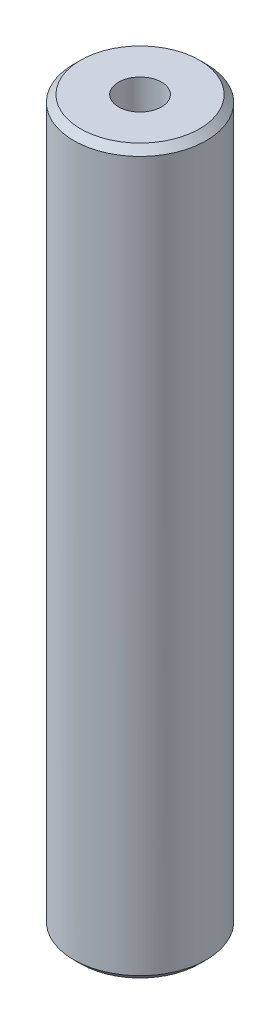
ISO-10303-21;
HEADER;
FILE_DESCRIPTION(('STEP AP214'),'2;1');
FILE_NAME('part.step','',(''),(''),'','','');
FILE_SCHEMA(('AUTOMOTIVE_DESIGN { 1 0 10303 214 1 1 1 1 }'));
ENDSEC;
DATA;
#1=APPLICATION_CONTEXT('core data for automotive mechanical design processes');
#2=APPLICATION_PROTOCOL_DEFINITION('international standard','automotive_design',2000,#1);
#3=PRODUCT_CONTEXT('',#1,'mechanical');
#4=PRODUCT('Part','Part','',(#3));
#5=PRODUCT_RELATED_PRODUCT_CATEGORY('part','',(#4));
#6=PRODUCT_DEFINITION_FORMATION('','',#4);
#7=PRODUCT_DEFINITION_CONTEXT('part definition',#1,'design');
#8=PRODUCT_DEFINITION('design','',#6,#7);
#9=PRODUCT_DEFINITION_SHAPE('','',#8);
#10=(LENGTH_UNIT() NAMED_UNIT(*) SI_UNIT(.MILLI.,.METRE.));
#11=(NAMED_UNIT(*) PLANE_ANGLE_UNIT() SI_UNIT($,.RADIAN.));
#12=(NAMED_UNIT(*) SI_UNIT($,.STERADIAN.) SOLID_ANGLE_UNIT());
#13=UNCERTAINTY_MEASURE_WITH_UNIT(LENGTH_MEASURE(1.E-05),#10,'distance_accuracy_value','');
#14=(GEOMETRIC_REPRESENTATION_CONTEXT(3) GLOBAL_UNCERTAINTY_ASSIGNED_CONTEXT((#13)) GLOBAL_UNIT_ASSIGNED_CONTEXT((#10,
#11,#12)) REPRESENTATION_CONTEXT('',''));
#15=CARTESIAN_POINT('',(0.,0.,0.));
#16=DIRECTION('',(0.,0.,1.));
#17=DIRECTION('',(1.,0.,0.));
#18=AXIS2_PLACEMENT_3D('',#15,#16,#17);
#19=CARTESIAN_POINT('',(0.,600.,0.));
#20=DIRECTION('',(0.,-1.,0.));
#21=DIRECTION('',(0.,0.,-1.));
#22=AXIS2_PLACEMENT_3D('',#19,#20,#21);
#23=CYLINDRICAL_SURFACE('',#22,55.);
#24=CARTESIAN_POINT('',(0.,594.358185625341,0.));
#25=DIRECTION('',(0.,1.,0.));
#26=DIRECTION('',(0.,0.,1.));
#27=AXIS2_PLACEMENT_3D('',#24,#25,#26);
#28=CIRCLE('',#27,55.);
#29=CARTESIAN_POINT('',(0.,594.358185625341,-55.));
#30=VERTEX_POINT('',#29);
#31=EDGE_CURVE('E50',#30,#30,#28,.F.);
#32=CARTESIAN_POINT('',(0.,5.64181437465916,0.));
#33=DIRECTION('',(0.,1.,0.));
#34=DIRECTION('',(0.,0.,1.));
#35=AXIS2_PLACEMENT_3D('',#32,#33,#34);
#36=CIRCLE('',#35,55.);
#37=CARTESIAN_POINT('',(0.,5.64181437465916,-55.));
#38=VERTEX_POINT('',#37);
#39=EDGE_CURVE('E51',#38,#38,#36,.T.);
#40=CARTESIAN_POINT('',(0.,594.358185625341,-55.));
#41=CARTESIAN_POINT('',(0.,588.225723424813,-55.));
#42=CARTESIAN_POINT('',(0.,582.093261224285,-55.));
#43=CARTESIAN_POINT('',(0.,569.828336823229,-55.));
#44=CARTESIAN_POINT('',(0.,563.695874622701,-55.));
#45=CARTESIAN_POINT('',(0.,551.430950221645,-55.));
#46=CARTESIAN_POINT('',(0.,545.298488021117,-55.));
#47=CARTESIAN_POINT('',(0.,533.033563620061,-55.));
#48=CARTESIAN_POINT('',(0.,526.901101419533,-55.));
#49=CARTESIAN_POINT('',(0.,514.636177018478,-55.));
#50=CARTESIAN_POINT('',(0.,508.50371481795,-55.));
#51=CARTESIAN_POINT('',(0.,496.238790416894,-55.));
#52=CARTESIAN_POINT('',(0.,490.106328216366,-55.));
#53=CARTESIAN_POINT('',(0.,477.84140381531,-55.));
#54=CARTESIAN_POINT('',(0.,471.708941614782,-55.));
#55=CARTESIAN_POINT('',(0.,459.444017213726,-55.));
#56=CARTESIAN_POINT('',(0.,453.311555013198,-55.));
#57=CARTESIAN_POINT('',(0.,441.046630612142,-55.));
#58=CARTESIAN_POINT('',(0.,434.914168411615,-55.));
#59=CARTESIAN_POINT('',(0.,422.649244010559,-55.));
#60=CARTESIAN_POINT('',(0.,416.516781810031,-55.));
#61=CARTESIAN_POINT('',(0.,404.251857408975,-55.));
#62=CARTESIAN_POINT('',(0.,398.119395208447,-55.));
#63=CARTESIAN_POINT('',(0.,385.854470807391,-55.));
#64=CARTESIAN_POINT('',(0.,379.722008606863,-55.));
#65=CARTESIAN_POINT('',(0.,367.457084205807,-55.));
#66=CARTESIAN_POINT('',(0.,361.324622005279,-55.));
#67=CARTESIAN_POINT('',(0.,349.059697604223,-55.));
#68=CARTESIAN_POINT('',(0.,342.927235403696,-55.));
#69=CARTESIAN_POINT('',(0.,330.66231100264,-55.));
#70=CARTESIAN_POINT('',(0.,324.529848802112,-55.));
#71=CARTESIAN_POINT('',(0.,312.264924401056,-55.));
#72=CARTESIAN_POINT('',(0.,306.132462200528,-55.));
#73=CARTESIAN_POINT('',(0.,293.867537799472,-55.));
#74=CARTESIAN_POINT('',(0.,287.735075598944,-55.));
#75=CARTESIAN_POINT('',(0.,275.470151197888,-55.));
#76=CARTESIAN_POINT('',(0.,269.33768899736,-55.));
#77=CARTESIAN_POINT('',(0.,257.072764596304,-55.));
#78=CARTESIAN_POINT('',(0.,250.940302395777,-55.));
#79=CARTESIAN_POINT('',(0.,238.675377994721,-55.));
#80=CARTESIAN_POINT('',(0.,232.542915794193,-55.));
#81=CARTESIAN_POINT('',(0.,220.277991393137,-55.));
#82=CARTESIAN_POINT('',(0.,214.145529192609,-55.));
#83=CARTESIAN_POINT('',(0.,201.880604791553,-55.));
#84=CARTESIAN_POINT('',(0.,195.748142591025,-55.));
#85=CARTESIAN_POINT('',(0.,183.483218189969,-55.));
#86=CARTESIAN_POINT('',(0.,177.350755989441,-55.));
#87=CARTESIAN_POINT('',(0.,165.085831588385,-55.));
#88=CARTESIAN_POINT('',(0.,158.953369387858,-55.));
#89=CARTESIAN_POINT('',(0.,146.688444986802,-55.));
#90=CARTESIAN_POINT('',(0.,140.555982786274,-55.));
#91=CARTESIAN_POINT('',(0.,128.291058385218,-55.));
#92=CARTESIAN_POINT('',(0.,122.15859618469,-55.));
#93=CARTESIAN_POINT('',(0.,109.893671783634,-55.));
#94=CARTESIAN_POINT('',(0.,103.761209583106,-55.));
#95=CARTESIAN_POINT('',(0.,91.4962851820503,-55.));
#96=CARTESIAN_POINT('',(0.,85.3638229815223,-55.));
#97=CARTESIAN_POINT('',(0.,73.0988985804664,-55.));
#98=CARTESIAN_POINT('',(0.,66.9664363799384,-55.));
#99=CARTESIAN_POINT('',(0.,54.7015119788826,-55.));
#100=CARTESIAN_POINT('',(0.,48.5690497783547,-55.));
#101=CARTESIAN_POINT('',(0.,36.3041253772989,-55.));
#102=CARTESIAN_POINT('',(0.,30.171663176771,-55.));
#103=CARTESIAN_POINT('',(0.,17.9067387757151,-55.));
#104=CARTESIAN_POINT('',(0.,11.7742765751871,-55.));
#105=CARTESIAN_POINT('',(0.,5.64181437465916,-55.));
#106=B_SPLINE_CURVE_WITH_KNOTS('',3,(#40,#41,#42,#43,#44,#45,#46,#47,#48,#49,#50,#51,#52,#53,
#54,#55,#56,#57,#58,#59,#60,#61,#62,#63,#64,#65,#66,#67,#68,#69,#70,#71,#72,#73,#74,#75,#76,#77,
#78,#79,#80,#81,#82,#83,#84,#85,#86,#87,#88,#89,#90,#91,#92,#93,#94,#95,#96,#97,#98,#99,#100,
#101,#102,#103,#104,#105),.UNSPECIFIED.,.F.,.F.,(4,2,2,2,2,2,2,2,2,2,2,2,2,2,2,2,2,2,2,2,2,2,2,
2,2,2,2,2,2,2,2,2,4),(0.,18.3973866015839,36.7947732031677,55.1921598047514,73.5895464063352,
91.986933007919,110.384319609503,128.781706211087,147.17909281267,165.576479414254,
183.973866015838,202.371252617422,220.768639219006,239.166025820589,257.563412422173,
275.960799023757,294.358185625341,312.755572226925,331.152958828508,349.550345430092,
367.947732031676,386.34511863326,404.742505234844,423.139891836427,441.537278438011,
459.934665039595,478.332051641179,496.729438242763,515.126824844347,533.52421144593,
551.921598047514,570.318984649098,588.716371250682),.UNSPECIFIED.);
#107=EDGE_CURVE('BSEAM39',#30,#38,#106,.T.);
#108=ORIENTED_EDGE('',*,*,#31,.T.);
#109=ORIENTED_EDGE('',*,*,#39,.T.);
#110=ORIENTED_EDGE('',*,*,#107,.T.);
#111=ORIENTED_EDGE('',*,*,#107,.F.);
#112=EDGE_LOOP('',(#108,#110,#109,#111));
#113=FACE_BOUND('',#112,.T.);
#114=ADVANCED_FACE('F39',(#113),#23,.T.);
#115=CARTESIAN_POINT('',(0.,600.,0.));
#116=DIRECTION('',(0.,1.,0.));
#117=DIRECTION('',(0.,0.,1.));
#118=AXIS2_PLACEMENT_3D('',#115,#116,#117);
#119=PLANE('',#118);
#120=CARTESIAN_POINT('',(0.,600.,0.));
#121=DIRECTION('',(0.,1.,0.));
#122=DIRECTION('',(0.,0.,1.));
#123=AXIS2_PLACEMENT_3D('',#120,#121,#122);
#124=CIRCLE('',#123,49.3581856253409);
#125=CARTESIAN_POINT('',(0.,600.,-49.3581856253409));
#126=VERTEX_POINT('',#125);
#127=EDGE_CURVE('E54',#126,#126,#124,.T.);
#128=ORIENTED_EDGE('',*,*,#127,.T.);
#129=EDGE_LOOP('',(#128));
#130=FACE_BOUND('',#129,.T.);
#131=CARTESIAN_POINT('',(0.,600.,0.));
#132=DIRECTION('',(0.,1.,0.));
#133=DIRECTION('',(0.,0.,1.));
#134=AXIS2_PLACEMENT_3D('',#131,#132,#133);
#135=CIRCLE('',#134,17.8302659874964);
#136=CARTESIAN_POINT('',(0.,600.,17.8302659874964));
#137=VERTEX_POINT('',#136);
#138=EDGE_CURVE('E58',#137,#137,#135,.T.);
#139=ORIENTED_EDGE('',*,*,#138,.F.);
#140=EDGE_LOOP('',(#139));
#141=FACE_BOUND('',#140,.T.);
#142=ADVANCED_FACE('F69',(#130,#141),#119,.T.);
#143=CARTESIAN_POINT('',(0.,0.,0.));
#144=DIRECTION('',(0.,1.,0.));
#145=DIRECTION('',(0.,0.,1.));
#146=AXIS2_PLACEMENT_3D('',#143,#144,#145);
#147=PLANE('',#146);
#148=CARTESIAN_POINT('',(0.,0.,0.));
#149=DIRECTION('',(0.,1.,0.));
#150=DIRECTION('',(0.,0.,1.));
#151=AXIS2_PLACEMENT_3D('',#148,#149,#150);
#152=CIRCLE('',#151,49.3581856253408);
#153=CARTESIAN_POINT('',(0.,0.,49.3581856253408));
#154=VERTEX_POINT('',#153);
#155=EDGE_CURVE('E10',#154,#154,#152,.F.);
#156=ORIENTED_EDGE('',*,*,#155,.T.);
#157=EDGE_LOOP('',(#156));
#158=FACE_BOUND('',#157,.T.);
#159=CARTESIAN_POINT('',(0.,0.,0.));
#160=DIRECTION('',(0.,1.,0.));
#161=DIRECTION('',(0.,0.,1.));
#162=AXIS2_PLACEMENT_3D('',#159,#160,#161);
#163=CIRCLE('',#162,17.8302659874964);
#164=CARTESIAN_POINT('',(0.,0.,17.8302659874964));
#165=VERTEX_POINT('',#164);
#166=EDGE_CURVE('E63',#165,#165,#163,.T.);
#167=ORIENTED_EDGE('',*,*,#166,.T.);
#168=EDGE_LOOP('',(#167));
#169=FACE_BOUND('',#168,.T.);
#170=ADVANCED_FACE('F75',(#158,#169),#147,.F.);
#171=CARTESIAN_POINT('',(0.,600.,0.));
#172=DIRECTION('',(0.,-1.,0.));
#173=DIRECTION('',(0.,0.,-1.));
#174=AXIS2_PLACEMENT_3D('',#171,#172,#173);
#175=CYLINDRICAL_SURFACE('',#174,17.8302659874964);
#176=ORIENTED_EDGE('',*,*,#138,.T.);
#177=EDGE_LOOP('',(#176));
#178=FACE_BOUND('',#177,.T.);
#179=ORIENTED_EDGE('',*,*,#166,.F.);
#180=EDGE_LOOP('',(#179));
#181=FACE_BOUND('',#180,.T.);
#182=ADVANCED_FACE('F70',(#178,#181),#175,.F.);
#183=CARTESIAN_POINT('',(0.,600.,0.));
#184=DIRECTION('',(0.,-1.,0.));
#185=DIRECTION('',(0.,0.,-1.));
#186=AXIS2_PLACEMENT_3D('',#183,#184,#185);
#187=CONICAL_SURFACE('',#186,49.3581856253409,0.785398163397444);
#188=CARTESIAN_POINT('',(0.,594.358185625341,-55.0000000000001));
#189=CARTESIAN_POINT('',(0.,594.416954525077,-54.941231100264));
#190=CARTESIAN_POINT('',(0.,594.475723424813,-54.882462200528));
#191=CARTESIAN_POINT('',(0.,594.593261224285,-54.7649244010559));
#192=CARTESIAN_POINT('',(0.,594.652030124021,-54.7061555013199));
#193=CARTESIAN_POINT('',(0.,594.769567923493,-54.5886177018478));
#194=CARTESIAN_POINT('',(0.,594.828336823229,-54.5298488021118));
#195=CARTESIAN_POINT('',(0.,594.945874622701,-54.4123110026397));
#196=CARTESIAN_POINT('',(0.,595.004643522437,-54.3535421029037));
#197=CARTESIAN_POINT('',(0.,595.122181321909,-54.2360043034316));
#198=CARTESIAN_POINT('',(0.,595.180950221645,-54.1772354036956));
#199=CARTESIAN_POINT('',(0.,595.298488021117,-54.0596976042235));
#200=CARTESIAN_POINT('',(0.,595.357256920853,-54.0009287044875));
#201=CARTESIAN_POINT('',(0.,595.474794720325,-53.8833909050154));
#202=CARTESIAN_POINT('',(0.,595.533563620061,-53.8246220052794));
#203=CARTESIAN_POINT('',(0.,595.651101419533,-53.7070842058073));
#204=CARTESIAN_POINT('',(0.,595.70987031927,-53.6483153060713));
#205=CARTESIAN_POINT('',(0.,595.827408118742,-53.5307775065993));
#206=CARTESIAN_POINT('',(0.,595.886177018478,-53.4720086068632));
#207=CARTESIAN_POINT('',(0.,596.00371481795,-53.3544708073911));
#208=CARTESIAN_POINT('',(0.,596.062483717686,-53.2957019076551));
#209=CARTESIAN_POINT('',(0.,596.180021517158,-53.1781641081831));
#210=CARTESIAN_POINT('',(0.,596.238790416894,-53.119395208447));
#211=CARTESIAN_POINT('',(0.,596.356328216366,-53.001857408975));
#212=CARTESIAN_POINT('',(0.,596.415097116102,-52.9430885092389));
#213=CARTESIAN_POINT('',(0.,596.532634915574,-52.8255507097669));
#214=CARTESIAN_POINT('',(0.,596.59140381531,-52.7667818100308));
#215=CARTESIAN_POINT('',(0.,596.708941614782,-52.6492440105588));
#216=CARTESIAN_POINT('',(0.,596.767710514518,-52.5904751108227));
#217=CARTESIAN_POINT('',(0.,596.88524831399,-52.4729373113507));
#218=CARTESIAN_POINT('',(0.,596.944017213726,-52.4141684116146));
#219=CARTESIAN_POINT('',(0.,597.061555013198,-52.2966306121426));
#220=CARTESIAN_POINT('',(0.,597.120323912934,-52.2378617124065));
#221=CARTESIAN_POINT('',(0.,597.237861712406,-52.1203239129345));
#222=CARTESIAN_POINT('',(0.,597.296630612142,-52.0615550131984));
#223=CARTESIAN_POINT('',(0.,597.414168411614,-51.9440172137264));
#224=CARTESIAN_POINT('',(0.,597.472937311351,-51.8852483139903));
#225=CARTESIAN_POINT('',(0.,597.590475110823,-51.7677105145183));
#226=CARTESIAN_POINT('',(0.,597.649244010559,-51.7089416147822));
#227=CARTESIAN_POINT('',(0.,597.766781810031,-51.5914038153102));
#228=CARTESIAN_POINT('',(0.,597.825550709767,-51.5326349155741));
#229=CARTESIAN_POINT('',(0.,597.943088509239,-51.4150971161021));
#230=CARTESIAN_POINT('',(0.,598.001857408975,-51.3563282163661));
#231=CARTESIAN_POINT('',(0.,598.119395208447,-51.238790416894));
#232=CARTESIAN_POINT('',(0.,598.178164108183,-51.1800215171579));
#233=CARTESIAN_POINT('',(0.,598.295701907655,-51.0624837176859));
#234=CARTESIAN_POINT('',(0.,598.354470807391,-51.0037148179499));
#235=CARTESIAN_POINT('',(0.,598.472008606863,-50.8861770184778));
#236=CARTESIAN_POINT('',(0.,598.530777506599,-50.8274081187418));
#237=CARTESIAN_POINT('',(0.,598.648315306071,-50.7098703192697));
#238=CARTESIAN_POINT('',(0.,598.707084205807,-50.6511014195337));
#239=CARTESIAN_POINT('',(0.,598.824622005279,-50.5335636200616));
#240=CARTESIAN_POINT('',(0.,598.883390905015,-50.4747947203256));
#241=CARTESIAN_POINT('',(0.,599.000928704487,-50.3572569208535));
#242=CARTESIAN_POINT('',(0.,599.059697604223,-50.2984880211175));
#243=CARTESIAN_POINT('',(0.,599.177235403695,-50.1809502216454));
#244=CARTESIAN_POINT('',(0.,599.236004303432,-50.1221813219094));
#245=CARTESIAN_POINT('',(0.,599.353542102903,-50.0046435224373));
#246=CARTESIAN_POINT('',(0.,599.41231100264,-49.9458746227013));
#247=CARTESIAN_POINT('',(0.,599.529848802112,-49.8283368232292));
#248=CARTESIAN_POINT('',(0.,599.588617701848,-49.7695679234932));
#249=CARTESIAN_POINT('',(0.,599.70615550132,-49.6520301240211));
#250=CARTESIAN_POINT('',(0.,599.764924401056,-49.5932612242851));
#251=CARTESIAN_POINT('',(0.,599.882462200528,-49.475723424813));
#252=CARTESIAN_POINT('',(0.,599.941231100264,-49.416954525077));
#253=CARTESIAN_POINT('',(0.,600.,-49.3581856253409));
#254=B_SPLINE_CURVE_WITH_KNOTS('',3,(#188,#189,#190,#191,#192,#193,#194,#195,#196,#197,#198,
#199,#200,#201,#202,#203,#204,#205,#206,#207,#208,#209,#210,#211,#212,#213,#214,#215,#216,#217,
#218,#219,#220,#221,#222,#223,#224,#225,#226,#227,#228,#229,#230,#231,#232,#233,#234,#235,#236,
#237,#238,#239,#240,#241,#242,#243,#244,#245,#246,#247,#248,#249,#250,#251,#252,#253),
.UNSPECIFIED.,.F.,.F.,(4,2,2,2,2,2,2,2,2,2,2,2,2,2,2,2,2,2,2,2,2,2,2,2,2,2,2,2,2,2,2,2,4),(0.,
0.249335325157401,0.498670650314723,0.74800597547205,0.997341300629372,1.24667662578669,
1.49601195094402,1.74534727610134,1.99468260125867,2.24401792641599,2.49335325157331,
2.74268857673064,2.99202390188796,3.24135922704529,3.49069455220261,3.74002987735993,
3.98936520251725,4.23870052767458,4.4880358528319,4.73737117798922,4.98670650314655,
5.23604182830387,5.4853771534612,5.73471247861852,5.98404780377584,6.23338312893317,
6.48271845409049,6.73205377924782,6.98138910440514,7.23072442956246,7.48005975471978,
7.72939507987711,7.97873040503451),.UNSPECIFIED.);
#255=EDGE_CURVE('BSEAM81',#30,#126,#254,.T.);
#256=ORIENTED_EDGE('',*,*,#31,.F.);
#257=ORIENTED_EDGE('',*,*,#127,.F.);
#258=ORIENTED_EDGE('',*,*,#255,.T.);
#259=ORIENTED_EDGE('',*,*,#255,.F.);
#260=EDGE_LOOP('',(#256,#258,#257,#259));
#261=FACE_BOUND('',#260,.T.);
#262=ADVANCED_FACE('F81',(#261),#187,.T.);
#263=CARTESIAN_POINT('',(0.,5.64181437465916,0.));
#264=DIRECTION('',(0.,1.,0.));
#265=DIRECTION('',(0.,0.,1.));
#266=AXIS2_PLACEMENT_3D('',#263,#264,#265);
#267=CONICAL_SURFACE('',#266,55.,0.785398163397449);
#268=ORIENTED_EDGE('',*,*,#155,.F.);
#269=EDGE_LOOP('',(#268));
#270=FACE_BOUND('',#269,.T.);
#271=ORIENTED_EDGE('',*,*,#39,.F.);
#272=EDGE_LOOP('',(#271));
#273=FACE_BOUND('',#272,.T.);
#274=ADVANCED_FACE('F45',(#270,#273),#267,.T.);
#275=CLOSED_SHELL('',(#114,#142,#170,#182,#262,#274));
#276=MANIFOLD_SOLID_BREP('B2',#275);
#277=ADVANCED_BREP_SHAPE_REPRESENTATION('',(#18,#276),#14);
#278=SHAPE_DEFINITION_REPRESENTATION(#9,#277);
ENDSEC;
END-ISO-10303-21;
